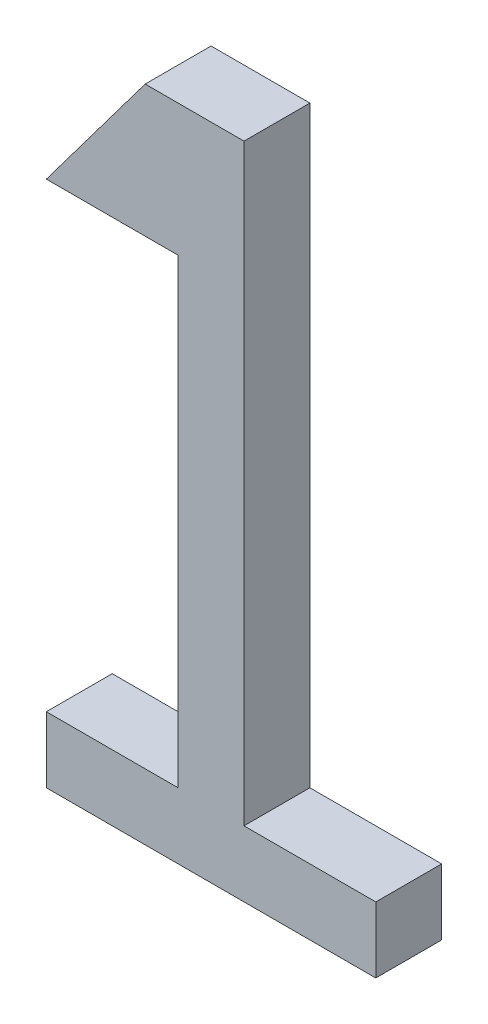
ISO-10303-21;
HEADER;
FILE_DESCRIPTION(('STEP AP214'),'2;1');
FILE_NAME('part.step','',(''),(''),'','','');
FILE_SCHEMA(('AUTOMOTIVE_DESIGN { 1 0 10303 214 1 1 1 1 }'));
ENDSEC;
DATA;
#1=APPLICATION_CONTEXT('core data for automotive mechanical design processes');
#2=APPLICATION_PROTOCOL_DEFINITION('international standard','automotive_design',2000,#1);
#3=PRODUCT_CONTEXT('',#1,'mechanical');
#4=PRODUCT('Part','Part','',(#3));
#5=PRODUCT_RELATED_PRODUCT_CATEGORY('part','',(#4));
#6=PRODUCT_DEFINITION_FORMATION('','',#4);
#7=PRODUCT_DEFINITION_CONTEXT('part definition',#1,'design');
#8=PRODUCT_DEFINITION('design','',#6,#7);
#9=PRODUCT_DEFINITION_SHAPE('','',#8);
#10=(LENGTH_UNIT() NAMED_UNIT(*) SI_UNIT(.MILLI.,.METRE.));
#11=(NAMED_UNIT(*) PLANE_ANGLE_UNIT() SI_UNIT($,.RADIAN.));
#12=(NAMED_UNIT(*) SI_UNIT($,.STERADIAN.) SOLID_ANGLE_UNIT());
#13=UNCERTAINTY_MEASURE_WITH_UNIT(LENGTH_MEASURE(1.E-05),#10,'distance_accuracy_value','');
#14=(GEOMETRIC_REPRESENTATION_CONTEXT(3) GLOBAL_UNCERTAINTY_ASSIGNED_CONTEXT((#13)) GLOBAL_UNIT_ASSIGNED_CONTEXT((#10,
#11,#12)) REPRESENTATION_CONTEXT('',''));
#15=CARTESIAN_POINT('',(0.,0.,0.));
#16=DIRECTION('',(0.,0.,1.));
#17=DIRECTION('',(1.,0.,0.));
#18=AXIS2_PLACEMENT_3D('',#15,#16,#17);
#19=CARTESIAN_POINT('',(-0.06349999999999,0.0762,0.0254));
#20=DIRECTION('',(0.,0.,1.));
#21=DIRECTION('',(1.,0.,0.));
#22=AXIS2_PLACEMENT_3D('',#19,#20,#21);
#23=PLANE('',#22);
#24=DIRECTION('',(1.,0.,0.));
#25=VECTOR('',#24,1.);
#26=CARTESIAN_POINT('',(-0.02539999999999,0.127,0.0254));
#27=LINE('',#26,#25);
#28=CARTESIAN_POINT('',(-0.02539999999999,0.127,0.0254));
#29=VERTEX_POINT('',#28);
#30=CARTESIAN_POINT('',(0.01270000000001,0.127,0.0254));
#31=VERTEX_POINT('',#30);
#32=EDGE_CURVE('E137',#29,#31,#27,.T.);
#33=ORIENTED_EDGE('',*,*,#32,.F.);
#34=DIRECTION('',(-0.6,-0.8,0.));
#35=VECTOR('',#34,1.);
#36=CARTESIAN_POINT('',(-0.06349999999999,0.0762,0.0254));
#37=LINE('',#36,#35);
#38=CARTESIAN_POINT('',(-0.06349999999999,0.0762,0.0254));
#39=VERTEX_POINT('',#38);
#40=EDGE_CURVE('E106',#39,#29,#37,.F.);
#41=ORIENTED_EDGE('',*,*,#40,.F.);
#42=DIRECTION('',(1.,0.,0.));
#43=VECTOR('',#42,1.);
#44=CARTESIAN_POINT('',(-0.0127,0.0762,0.0254));
#45=LINE('',#44,#43);
#46=CARTESIAN_POINT('',(-0.0127,0.0762,0.0254));
#47=VERTEX_POINT('',#46);
#48=EDGE_CURVE('E20',#47,#39,#45,.F.);
#49=ORIENTED_EDGE('',*,*,#48,.F.);
#50=DIRECTION('',(0.,1.,0.));
#51=VECTOR('',#50,1.);
#52=CARTESIAN_POINT('',(-0.0127,-0.1016,0.0254));
#53=LINE('',#52,#51);
#54=CARTESIAN_POINT('',(-0.0127,-0.1016,0.0254));
#55=VERTEX_POINT('',#54);
#56=EDGE_CURVE('E95',#55,#47,#53,.T.);
#57=ORIENTED_EDGE('',*,*,#56,.F.);
#58=DIRECTION('',(1.,0.,0.));
#59=VECTOR('',#58,1.);
#60=CARTESIAN_POINT('',(-0.06349999999999,-0.1016,0.0254));
#61=LINE('',#60,#59);
#62=CARTESIAN_POINT('',(-0.06349999999999,-0.1016,0.0254));
#63=VERTEX_POINT('',#62);
#64=EDGE_CURVE('E90',#63,#55,#61,.T.);
#65=ORIENTED_EDGE('',*,*,#64,.F.);
#66=DIRECTION('',(0.,1.,0.));
#67=VECTOR('',#66,1.);
#68=CARTESIAN_POINT('',(-0.06349999999999,-0.127,0.0254));
#69=LINE('',#68,#67);
#70=CARTESIAN_POINT('',(-0.06349999999999,-0.127,0.0254));
#71=VERTEX_POINT('',#70);
#72=EDGE_CURVE('E117',#71,#63,#69,.T.);
#73=ORIENTED_EDGE('',*,*,#72,.F.);
#74=DIRECTION('',(1.,0.,0.));
#75=VECTOR('',#74,1.);
#76=CARTESIAN_POINT('',(0.0635,-0.127,0.0254));
#77=LINE('',#76,#75);
#78=CARTESIAN_POINT('',(0.0635,-0.127,0.0254));
#79=VERTEX_POINT('',#78);
#80=EDGE_CURVE('E121',#79,#71,#77,.F.);
#81=ORIENTED_EDGE('',*,*,#80,.F.);
#82=DIRECTION('',(0.,1.,0.));
#83=VECTOR('',#82,1.);
#84=CARTESIAN_POINT('',(0.0635,-0.1016,0.0254));
#85=LINE('',#84,#83);
#86=CARTESIAN_POINT('',(0.0635,-0.1016,0.0254));
#87=VERTEX_POINT('',#86);
#88=EDGE_CURVE('E125',#87,#79,#85,.F.);
#89=ORIENTED_EDGE('',*,*,#88,.F.);
#90=DIRECTION('',(1.,0.,0.));
#91=VECTOR('',#90,1.);
#92=CARTESIAN_POINT('',(0.01270000000001,-0.1016,0.0254));
#93=LINE('',#92,#91);
#94=CARTESIAN_POINT('',(0.01270000000001,-0.1016,0.0254));
#95=VERTEX_POINT('',#94);
#96=EDGE_CURVE('E129',#95,#87,#93,.T.);
#97=ORIENTED_EDGE('',*,*,#96,.F.);
#98=DIRECTION('',(0.,1.,0.));
#99=VECTOR('',#98,1.);
#100=CARTESIAN_POINT('',(0.01270000000001,0.127,0.0254));
#101=LINE('',#100,#99);
#102=EDGE_CURVE('E133',#31,#95,#101,.F.);
#103=ORIENTED_EDGE('',*,*,#102,.F.);
#104=EDGE_LOOP('',(#33,#41,#49,#57,#65,#73,#81,#89,#97,#103));
#105=FACE_BOUND('',#104,.T.);
#106=ADVANCED_FACE('F17',(#105),#23,.T.);
#107=CARTESIAN_POINT('',(-0.0127,0.0762,0.));
#108=DIRECTION('',(0.,-1.,0.));
#109=DIRECTION('',(0.,0.,-1.));
#110=AXIS2_PLACEMENT_3D('',#107,#108,#109);
#111=PLANE('',#110);
#112=DIRECTION('',(0.,0.,1.));
#113=VECTOR('',#112,1.);
#114=CARTESIAN_POINT('',(-0.06349999999999,0.0762,0.));
#115=LINE('',#114,#113);
#116=CARTESIAN_POINT('',(-0.06349999999999,0.0762,0.));
#117=VERTEX_POINT('',#116);
#118=EDGE_CURVE('E141',#117,#39,#115,.T.);
#119=ORIENTED_EDGE('',*,*,#118,.F.);
#120=DIRECTION('',(1.,0.,0.));
#121=VECTOR('',#120,1.);
#122=CARTESIAN_POINT('',(-0.06349999999999,0.0762,0.));
#123=LINE('',#122,#121);
#124=CARTESIAN_POINT('',(-0.0127,0.0762,0.));
#125=VERTEX_POINT('',#124);
#126=EDGE_CURVE('E112',#117,#125,#123,.T.);
#127=ORIENTED_EDGE('',*,*,#126,.T.);
#128=DIRECTION('',(0.,0.,1.));
#129=VECTOR('',#128,1.);
#130=CARTESIAN_POINT('',(-0.0127,0.0762,0.));
#131=LINE('',#130,#129);
#132=EDGE_CURVE('E100',#47,#125,#131,.F.);
#133=ORIENTED_EDGE('',*,*,#132,.F.);
#134=ORIENTED_EDGE('',*,*,#48,.T.);
#135=EDGE_LOOP('',(#119,#127,#133,#134));
#136=FACE_BOUND('',#135,.T.);
#137=ADVANCED_FACE('F111',(#136),#111,.T.);
#138=CARTESIAN_POINT('',(-0.0127,-0.1016,0.));
#139=DIRECTION('',(-1.,0.,0.));
#140=DIRECTION('',(0.,0.,1.));
#141=AXIS2_PLACEMENT_3D('',#138,#139,#140);
#142=PLANE('',#141);
#143=ORIENTED_EDGE('',*,*,#132,.T.);
#144=DIRECTION('',(0.,1.,0.));
#145=VECTOR('',#144,1.);
#146=CARTESIAN_POINT('',(-0.0127,0.0762,0.));
#147=LINE('',#146,#145);
#148=CARTESIAN_POINT('',(-0.0127,-0.1016,0.));
#149=VERTEX_POINT('',#148);
#150=EDGE_CURVE('E146',#125,#149,#147,.F.);
#151=ORIENTED_EDGE('',*,*,#150,.T.);
#152=DIRECTION('',(0.,0.,1.));
#153=VECTOR('',#152,1.);
#154=CARTESIAN_POINT('',(-0.0127,-0.1016,0.));
#155=LINE('',#154,#153);
#156=EDGE_CURVE('E102',#55,#149,#155,.F.);
#157=ORIENTED_EDGE('',*,*,#156,.F.);
#158=ORIENTED_EDGE('',*,*,#56,.T.);
#159=EDGE_LOOP('',(#143,#151,#157,#158));
#160=FACE_BOUND('',#159,.T.);
#161=ADVANCED_FACE('F97',(#160),#142,.T.);
#162=CARTESIAN_POINT('',(-0.06349999999999,-0.1016,0.));
#163=DIRECTION('',(0.,1.,0.));
#164=DIRECTION('',(0.,0.,1.));
#165=AXIS2_PLACEMENT_3D('',#162,#163,#164);
#166=PLANE('',#165);
#167=ORIENTED_EDGE('',*,*,#156,.T.);
#168=DIRECTION('',(1.,0.,0.));
#169=VECTOR('',#168,1.);
#170=CARTESIAN_POINT('',(-0.06349999999999,-0.1016,0.));
#171=LINE('',#170,#169);
#172=CARTESIAN_POINT('',(-0.06349999999999,-0.1016,0.));
#173=VERTEX_POINT('',#172);
#174=EDGE_CURVE('E148',#149,#173,#171,.F.);
#175=ORIENTED_EDGE('',*,*,#174,.T.);
#176=DIRECTION('',(0.,0.,1.));
#177=VECTOR('',#176,1.);
#178=CARTESIAN_POINT('',(-0.06349999999999,-0.1016,0.));
#179=LINE('',#178,#177);
#180=EDGE_CURVE('E119',#63,#173,#179,.F.);
#181=ORIENTED_EDGE('',*,*,#180,.F.);
#182=ORIENTED_EDGE('',*,*,#64,.T.);
#183=EDGE_LOOP('',(#167,#175,#181,#182));
#184=FACE_BOUND('',#183,.T.);
#185=ADVANCED_FACE('F198',(#184),#166,.T.);
#186=CARTESIAN_POINT('',(-0.06349999999999,-0.127,0.));
#187=DIRECTION('',(-1.,0.,0.));
#188=DIRECTION('',(0.,0.,1.));
#189=AXIS2_PLACEMENT_3D('',#186,#187,#188);
#190=PLANE('',#189);
#191=ORIENTED_EDGE('',*,*,#180,.T.);
#192=DIRECTION('',(0.,1.,0.));
#193=VECTOR('',#192,1.);
#194=CARTESIAN_POINT('',(-0.06349999999999,0.0762,0.));
#195=LINE('',#194,#193);
#196=CARTESIAN_POINT('',(-0.06349999999999,-0.127,0.));
#197=VERTEX_POINT('',#196);
#198=EDGE_CURVE('E151',#173,#197,#195,.F.);
#199=ORIENTED_EDGE('',*,*,#198,.T.);
#200=DIRECTION('',(0.,0.,-1.));
#201=VECTOR('',#200,1.);
#202=CARTESIAN_POINT('',(-0.06349999999999,-0.127,0.));
#203=LINE('',#202,#201);
#204=EDGE_CURVE('E123',#71,#197,#203,.T.);
#205=ORIENTED_EDGE('',*,*,#204,.F.);
#206=ORIENTED_EDGE('',*,*,#72,.T.);
#207=EDGE_LOOP('',(#191,#199,#205,#206));
#208=FACE_BOUND('',#207,.T.);
#209=ADVANCED_FACE('F197',(#208),#190,.T.);
#210=CARTESIAN_POINT('',(0.0635,-0.127,0.));
#211=DIRECTION('',(0.,-1.,0.));
#212=DIRECTION('',(0.,0.,-1.));
#213=AXIS2_PLACEMENT_3D('',#210,#211,#212);
#214=PLANE('',#213);
#215=ORIENTED_EDGE('',*,*,#204,.T.);
#216=DIRECTION('',(1.,0.,0.));
#217=VECTOR('',#216,1.);
#218=CARTESIAN_POINT('',(-0.06349999999999,-0.127,0.));
#219=LINE('',#218,#217);
#220=CARTESIAN_POINT('',(0.0635,-0.127,0.));
#221=VERTEX_POINT('',#220);
#222=EDGE_CURVE('E154',#197,#221,#219,.T.);
#223=ORIENTED_EDGE('',*,*,#222,.T.);
#224=DIRECTION('',(0.,0.,-1.));
#225=VECTOR('',#224,1.);
#226=CARTESIAN_POINT('',(0.0635,-0.127,0.));
#227=LINE('',#226,#225);
#228=EDGE_CURVE('E127',#79,#221,#227,.T.);
#229=ORIENTED_EDGE('',*,*,#228,.F.);
#230=ORIENTED_EDGE('',*,*,#80,.T.);
#231=EDGE_LOOP('',(#215,#223,#229,#230));
#232=FACE_BOUND('',#231,.T.);
#233=ADVANCED_FACE('F191',(#232),#214,.T.);
#234=CARTESIAN_POINT('',(0.0635,-0.1016,0.));
#235=DIRECTION('',(1.,0.,0.));
#236=DIRECTION('',(0.,0.,-1.));
#237=AXIS2_PLACEMENT_3D('',#234,#235,#236);
#238=PLANE('',#237);
#239=ORIENTED_EDGE('',*,*,#228,.T.);
#240=DIRECTION('',(0.,1.,0.));
#241=VECTOR('',#240,1.);
#242=CARTESIAN_POINT('',(0.0635,0.0762,0.));
#243=LINE('',#242,#241);
#244=CARTESIAN_POINT('',(0.0635,-0.1016,0.));
#245=VERTEX_POINT('',#244);
#246=EDGE_CURVE('E157',#221,#245,#243,.T.);
#247=ORIENTED_EDGE('',*,*,#246,.T.);
#248=DIRECTION('',(0.,0.,1.));
#249=VECTOR('',#248,1.);
#250=CARTESIAN_POINT('',(0.0635,-0.1016,0.));
#251=LINE('',#250,#249);
#252=EDGE_CURVE('E131',#87,#245,#251,.F.);
#253=ORIENTED_EDGE('',*,*,#252,.F.);
#254=ORIENTED_EDGE('',*,*,#88,.T.);
#255=EDGE_LOOP('',(#239,#247,#253,#254));
#256=FACE_BOUND('',#255,.T.);
#257=ADVANCED_FACE('F187',(#256),#238,.T.);
#258=CARTESIAN_POINT('',(0.01270000000001,-0.1016,0.));
#259=DIRECTION('',(0.,1.,0.));
#260=DIRECTION('',(0.,0.,1.));
#261=AXIS2_PLACEMENT_3D('',#258,#259,#260);
#262=PLANE('',#261);
#263=ORIENTED_EDGE('',*,*,#252,.T.);
#264=DIRECTION('',(1.,0.,0.));
#265=VECTOR('',#264,1.);
#266=CARTESIAN_POINT('',(-0.06349999999999,-0.1016,0.));
#267=LINE('',#266,#265);
#268=CARTESIAN_POINT('',(0.01270000000001,-0.1016,0.));
#269=VERTEX_POINT('',#268);
#270=EDGE_CURVE('E160',#245,#269,#267,.F.);
#271=ORIENTED_EDGE('',*,*,#270,.T.);
#272=DIRECTION('',(0.,0.,-1.));
#273=VECTOR('',#272,1.);
#274=CARTESIAN_POINT('',(0.01270000000001,-0.1016,0.));
#275=LINE('',#274,#273);
#276=EDGE_CURVE('E135',#95,#269,#275,.T.);
#277=ORIENTED_EDGE('',*,*,#276,.F.);
#278=ORIENTED_EDGE('',*,*,#96,.T.);
#279=EDGE_LOOP('',(#263,#271,#277,#278));
#280=FACE_BOUND('',#279,.T.);
#281=ADVANCED_FACE('F181',(#280),#262,.T.);
#282=CARTESIAN_POINT('',(0.01270000000001,0.127,0.));
#283=DIRECTION('',(1.,0.,0.));
#284=DIRECTION('',(0.,0.,-1.));
#285=AXIS2_PLACEMENT_3D('',#282,#283,#284);
#286=PLANE('',#285);
#287=ORIENTED_EDGE('',*,*,#276,.T.);
#288=DIRECTION('',(0.,1.,0.));
#289=VECTOR('',#288,1.);
#290=CARTESIAN_POINT('',(0.01270000000001,0.0762,0.));
#291=LINE('',#290,#289);
#292=CARTESIAN_POINT('',(0.01270000000001,0.127,0.));
#293=VERTEX_POINT('',#292);
#294=EDGE_CURVE('E163',#269,#293,#291,.T.);
#295=ORIENTED_EDGE('',*,*,#294,.T.);
#296=DIRECTION('',(0.,0.,1.));
#297=VECTOR('',#296,1.);
#298=CARTESIAN_POINT('',(0.01270000000001,0.127,0.));
#299=LINE('',#298,#297);
#300=EDGE_CURVE('E139',#31,#293,#299,.F.);
#301=ORIENTED_EDGE('',*,*,#300,.F.);
#302=ORIENTED_EDGE('',*,*,#102,.T.);
#303=EDGE_LOOP('',(#287,#295,#301,#302));
#304=FACE_BOUND('',#303,.T.);
#305=ADVANCED_FACE('F176',(#304),#286,.T.);
#306=CARTESIAN_POINT('',(-0.02539999999999,0.127,0.));
#307=DIRECTION('',(0.,1.,0.));
#308=DIRECTION('',(0.,0.,1.));
#309=AXIS2_PLACEMENT_3D('',#306,#307,#308);
#310=PLANE('',#309);
#311=ORIENTED_EDGE('',*,*,#300,.T.);
#312=DIRECTION('',(1.,0.,0.));
#313=VECTOR('',#312,1.);
#314=CARTESIAN_POINT('',(-0.06349999999999,0.127,0.));
#315=LINE('',#314,#313);
#316=CARTESIAN_POINT('',(-0.02539999999999,0.127,0.));
#317=VERTEX_POINT('',#316);
#318=EDGE_CURVE('E26',#293,#317,#315,.F.);
#319=ORIENTED_EDGE('',*,*,#318,.T.);
#320=DIRECTION('',(0.,0.,1.));
#321=VECTOR('',#320,1.);
#322=CARTESIAN_POINT('',(-0.02539999999999,0.127,0.));
#323=LINE('',#322,#321);
#324=EDGE_CURVE('E34',#29,#317,#323,.F.);
#325=ORIENTED_EDGE('',*,*,#324,.F.);
#326=ORIENTED_EDGE('',*,*,#32,.T.);
#327=EDGE_LOOP('',(#311,#319,#325,#326));
#328=FACE_BOUND('',#327,.T.);
#329=ADVANCED_FACE('F169',(#328),#310,.T.);
#330=CARTESIAN_POINT('',(-0.06349999999999,0.0762,0.));
#331=DIRECTION('',(-0.8,0.6,0.));
#332=DIRECTION('',(-0.6,-0.8,0.));
#333=AXIS2_PLACEMENT_3D('',#330,#331,#332);
#334=PLANE('',#333);
#335=ORIENTED_EDGE('',*,*,#324,.T.);
#336=DIRECTION('',(-0.6,-0.8,0.));
#337=VECTOR('',#336,1.);
#338=CARTESIAN_POINT('',(-0.02539999999999,0.127,0.));
#339=LINE('',#338,#337);
#340=EDGE_CURVE('E11',#317,#117,#339,.T.);
#341=ORIENTED_EDGE('',*,*,#340,.T.);
#342=ORIENTED_EDGE('',*,*,#118,.T.);
#343=ORIENTED_EDGE('',*,*,#40,.T.);
#344=EDGE_LOOP('',(#335,#341,#342,#343));
#345=FACE_BOUND('',#344,.T.);
#346=ADVANCED_FACE('F199',(#345),#334,.T.);
#347=CARTESIAN_POINT('',(-0.06349999999999,0.0762,0.));
#348=DIRECTION('',(0.,0.,1.));
#349=DIRECTION('',(1.,0.,0.));
#350=AXIS2_PLACEMENT_3D('',#347,#348,#349);
#351=PLANE('',#350);
#352=ORIENTED_EDGE('',*,*,#318,.F.);
#353=ORIENTED_EDGE('',*,*,#294,.F.);
#354=ORIENTED_EDGE('',*,*,#270,.F.);
#355=ORIENTED_EDGE('',*,*,#246,.F.);
#356=ORIENTED_EDGE('',*,*,#222,.F.);
#357=ORIENTED_EDGE('',*,*,#198,.F.);
#358=ORIENTED_EDGE('',*,*,#174,.F.);
#359=ORIENTED_EDGE('',*,*,#150,.F.);
#360=ORIENTED_EDGE('',*,*,#126,.F.);
#361=ORIENTED_EDGE('',*,*,#340,.F.);
#362=EDGE_LOOP('',(#352,#353,#354,#355,#356,#357,#358,#359,#360,#361));
#363=FACE_BOUND('',#362,.T.);
#364=ADVANCED_FACE('F173',(#363),#351,.F.);
#365=CLOSED_SHELL('',(#106,#137,#161,#185,#209,#233,#257,#281,#305,#329,#346,#364));
#366=MANIFOLD_SOLID_BREP('B1',#365);
#367=ADVANCED_BREP_SHAPE_REPRESENTATION('',(#18,#366),#14);
#368=SHAPE_DEFINITION_REPRESENTATION(#9,#367);
ENDSEC;
END-ISO-10303-21;
